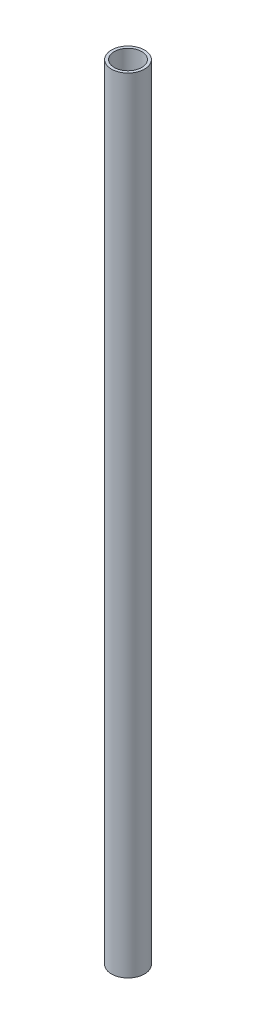
ISO-10303-21;
HEADER;
FILE_DESCRIPTION(('STEP AP214'),'2;1');
FILE_NAME('part.step','',(''),(''),'','','');
FILE_SCHEMA(('AUTOMOTIVE_DESIGN { 1 0 10303 214 1 1 1 1 }'));
ENDSEC;
DATA;
#1=APPLICATION_CONTEXT('core data for automotive mechanical design processes');
#2=APPLICATION_PROTOCOL_DEFINITION('international standard','automotive_design',2000,#1);
#3=PRODUCT_CONTEXT('',#1,'mechanical');
#4=PRODUCT('Part','Part','',(#3));
#5=PRODUCT_RELATED_PRODUCT_CATEGORY('part','',(#4));
#6=PRODUCT_DEFINITION_FORMATION('','',#4);
#7=PRODUCT_DEFINITION_CONTEXT('part definition',#1,'design');
#8=PRODUCT_DEFINITION('design','',#6,#7);
#9=PRODUCT_DEFINITION_SHAPE('','',#8);
#10=(LENGTH_UNIT() NAMED_UNIT(*) SI_UNIT(.MILLI.,.METRE.));
#11=(NAMED_UNIT(*) PLANE_ANGLE_UNIT() SI_UNIT($,.RADIAN.));
#12=(NAMED_UNIT(*) SI_UNIT($,.STERADIAN.) SOLID_ANGLE_UNIT());
#13=UNCERTAINTY_MEASURE_WITH_UNIT(LENGTH_MEASURE(1.E-05),#10,'distance_accuracy_value','');
#14=(GEOMETRIC_REPRESENTATION_CONTEXT(3) GLOBAL_UNCERTAINTY_ASSIGNED_CONTEXT((#13)) GLOBAL_UNIT_ASSIGNED_CONTEXT((#10,
#11,#12)) REPRESENTATION_CONTEXT('',''));
#15=CARTESIAN_POINT('',(0.,0.,0.));
#16=DIRECTION('',(0.,0.,1.));
#17=DIRECTION('',(1.,0.,0.));
#18=AXIS2_PLACEMENT_3D('',#15,#16,#17);
#19=CARTESIAN_POINT('',(0.,996.95,0.));
#20=DIRECTION('',(0.,1.,0.));
#21=DIRECTION('',(0.,0.,1.));
#22=AXIS2_PLACEMENT_3D('',#19,#20,#21);
#23=PLANE('',#22);
#24=CARTESIAN_POINT('',(0.,996.95,0.));
#25=DIRECTION('',(0.,1.,0.));
#26=DIRECTION('',(0.,0.,1.));
#27=AXIS2_PLACEMENT_3D('',#24,#25,#26);
#28=CIRCLE('',#27,21.082);
#29=CARTESIAN_POINT('',(0.,996.95,21.082));
#30=VERTEX_POINT('',#29);
#31=EDGE_CURVE('E10',#30,#30,#28,.T.);
#32=ORIENTED_EDGE('',*,*,#31,.T.);
#33=EDGE_LOOP('',(#32));
#34=FACE_BOUND('',#33,.T.);
#35=CARTESIAN_POINT('',(0.,996.95,0.));
#36=DIRECTION('',(0.,1.,0.));
#37=DIRECTION('',(0.,0.,1.));
#38=AXIS2_PLACEMENT_3D('',#35,#36,#37);
#39=CIRCLE('',#38,17.526);
#40=CARTESIAN_POINT('',(0.,996.95,17.526));
#41=VERTEX_POINT('',#40);
#42=EDGE_CURVE('E39',#41,#41,#39,.T.);
#43=ORIENTED_EDGE('',*,*,#42,.F.);
#44=EDGE_LOOP('',(#43));
#45=FACE_BOUND('',#44,.T.);
#46=ADVANCED_FACE('F28',(#34,#45),#23,.T.);
#47=CARTESIAN_POINT('',(0.,0.,0.));
#48=DIRECTION('',(0.,1.,0.));
#49=DIRECTION('',(0.,0.,1.));
#50=AXIS2_PLACEMENT_3D('',#47,#48,#49);
#51=PLANE('',#50);
#52=CARTESIAN_POINT('',(0.,0.,0.));
#53=DIRECTION('',(0.,1.,0.));
#54=DIRECTION('',(0.,0.,1.));
#55=AXIS2_PLACEMENT_3D('',#52,#53,#54);
#56=CIRCLE('',#55,21.082);
#57=CARTESIAN_POINT('',(0.,0.,21.082));
#58=VERTEX_POINT('',#57);
#59=EDGE_CURVE('E32',#58,#58,#56,.T.);
#60=ORIENTED_EDGE('',*,*,#59,.F.);
#61=EDGE_LOOP('',(#60));
#62=FACE_BOUND('',#61,.T.);
#63=CARTESIAN_POINT('',(0.,0.,0.));
#64=DIRECTION('',(0.,1.,0.));
#65=DIRECTION('',(0.,0.,1.));
#66=AXIS2_PLACEMENT_3D('',#63,#64,#65);
#67=CIRCLE('',#66,17.526);
#68=CARTESIAN_POINT('',(0.,0.,17.526));
#69=VERTEX_POINT('',#68);
#70=EDGE_CURVE('E41',#69,#69,#67,.T.);
#71=ORIENTED_EDGE('',*,*,#70,.T.);
#72=EDGE_LOOP('',(#71));
#73=FACE_BOUND('',#72,.T.);
#74=ADVANCED_FACE('F51',(#62,#73),#51,.F.);
#75=CARTESIAN_POINT('',(0.,996.95,0.));
#76=DIRECTION('',(0.,-1.,0.));
#77=DIRECTION('',(0.,0.,-1.));
#78=AXIS2_PLACEMENT_3D('',#75,#76,#77);
#79=CYLINDRICAL_SURFACE('',#78,21.082);
#80=ORIENTED_EDGE('',*,*,#31,.F.);
#81=EDGE_LOOP('',(#80));
#82=FACE_BOUND('',#81,.T.);
#83=ORIENTED_EDGE('',*,*,#59,.T.);
#84=EDGE_LOOP('',(#83));
#85=FACE_BOUND('',#84,.T.);
#86=ADVANCED_FACE('F30',(#82,#85),#79,.T.);
#87=CARTESIAN_POINT('',(0.,996.95,0.));
#88=DIRECTION('',(0.,-1.,0.));
#89=DIRECTION('',(0.,0.,-1.));
#90=AXIS2_PLACEMENT_3D('',#87,#88,#89);
#91=CYLINDRICAL_SURFACE('',#90,17.526);
#92=ORIENTED_EDGE('',*,*,#42,.T.);
#93=EDGE_LOOP('',(#92));
#94=FACE_BOUND('',#93,.T.);
#95=ORIENTED_EDGE('',*,*,#70,.F.);
#96=EDGE_LOOP('',(#95));
#97=FACE_BOUND('',#96,.T.);
#98=ADVANCED_FACE('F47',(#94,#97),#91,.F.);
#99=CLOSED_SHELL('',(#46,#74,#86,#98));
#100=MANIFOLD_SOLID_BREP('B2',#99);
#101=ADVANCED_BREP_SHAPE_REPRESENTATION('',(#18,#100),#14);
#102=SHAPE_DEFINITION_REPRESENTATION(#9,#101);
ENDSEC;
END-ISO-10303-21;
